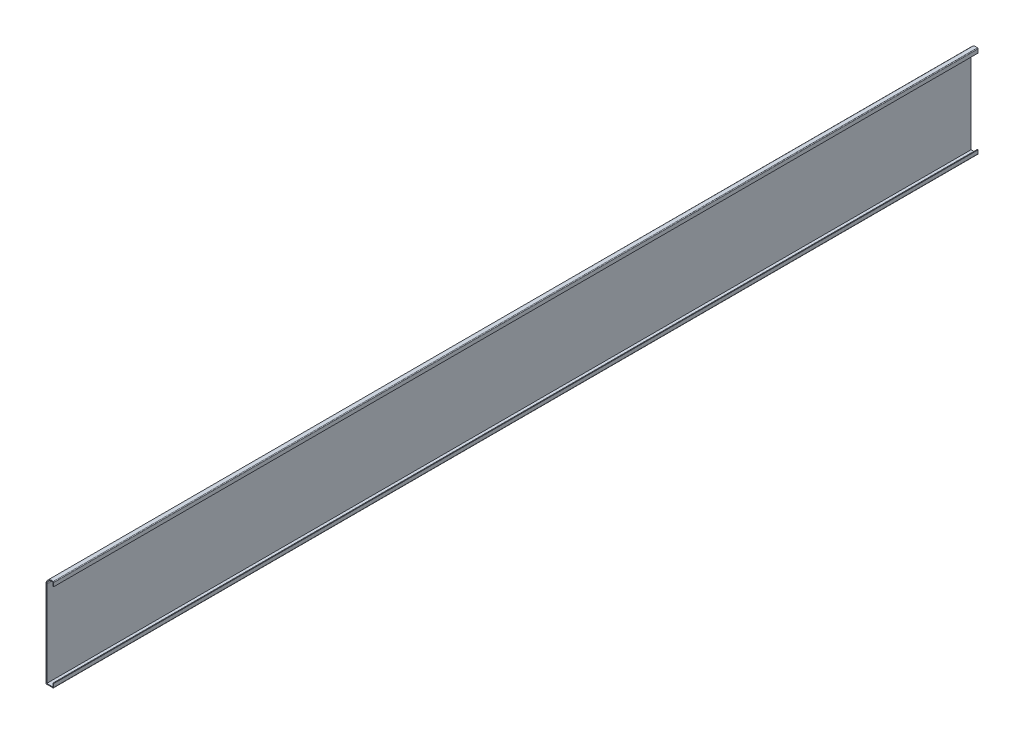
ISO-10303-21;
HEADER;
FILE_DESCRIPTION(('STEP AP214'),'2;1');
FILE_NAME('part.step','',(''),(''),'','','');
FILE_SCHEMA(('AUTOMOTIVE_DESIGN { 1 0 10303 214 1 1 1 1 }'));
ENDSEC;
DATA;
#1=APPLICATION_CONTEXT('core data for automotive mechanical design processes');
#2=APPLICATION_PROTOCOL_DEFINITION('international standard','automotive_design',2000,#1);
#3=PRODUCT_CONTEXT('',#1,'mechanical');
#4=PRODUCT('Part','Part','',(#3));
#5=PRODUCT_RELATED_PRODUCT_CATEGORY('part','',(#4));
#6=PRODUCT_DEFINITION_FORMATION('','',#4);
#7=PRODUCT_DEFINITION_CONTEXT('part definition',#1,'design');
#8=PRODUCT_DEFINITION('design','',#6,#7);
#9=PRODUCT_DEFINITION_SHAPE('','',#8);
#10=(LENGTH_UNIT() NAMED_UNIT(*) SI_UNIT(.MILLI.,.METRE.));
#11=(NAMED_UNIT(*) PLANE_ANGLE_UNIT() SI_UNIT($,.RADIAN.));
#12=(NAMED_UNIT(*) SI_UNIT($,.STERADIAN.) SOLID_ANGLE_UNIT());
#13=UNCERTAINTY_MEASURE_WITH_UNIT(LENGTH_MEASURE(1.E-05),#10,'distance_accuracy_value','');
#14=(GEOMETRIC_REPRESENTATION_CONTEXT(3) GLOBAL_UNCERTAINTY_ASSIGNED_CONTEXT((#13)) GLOBAL_UNIT_ASSIGNED_CONTEXT((#10,
#11,#12)) REPRESENTATION_CONTEXT('',''));
#15=CARTESIAN_POINT('',(0.,0.,0.));
#16=DIRECTION('',(0.,0.,1.));
#17=DIRECTION('',(1.,0.,0.));
#18=AXIS2_PLACEMENT_3D('',#15,#16,#17);
#19=CARTESIAN_POINT('',(-1.27,151.855256121069,-1524.));
#20=DIRECTION('',(-1.,0.,0.));
#21=DIRECTION('',(0.,-1.,0.));
#22=AXIS2_PLACEMENT_3D('',#19,#20,#21);
#23=PLANE('',#22);
#24=DIRECTION('',(0.,-1.,0.));
#25=VECTOR('',#24,1.);
#26=CARTESIAN_POINT('',(-1.27,151.855256121069,0.));
#27=LINE('',#26,#25);
#28=CARTESIAN_POINT('',(-1.27,150.907185256828,0.));
#29=VERTEX_POINT('',#28);
#30=CARTESIAN_POINT('',(-1.27,144.997256121069,0.));
#31=VERTEX_POINT('',#30);
#32=EDGE_CURVE('E194',#29,#31,#27,.T.);
#33=ORIENTED_EDGE('',*,*,#32,.F.);
#34=DIRECTION('',(0.,0.,1.));
#35=VECTOR('',#34,1.);
#36=CARTESIAN_POINT('',(-1.27,150.907185256828,-1524.));
#37=LINE('',#36,#35);
#38=CARTESIAN_POINT('',(-1.27,150.907185256828,-1524.));
#39=VERTEX_POINT('',#38);
#40=EDGE_CURVE('E165',#39,#29,#37,.T.);
#41=ORIENTED_EDGE('',*,*,#40,.F.);
#42=DIRECTION('',(0.,-1.,0.));
#43=VECTOR('',#42,1.);
#44=CARTESIAN_POINT('',(-1.27,151.855256121069,-1524.));
#45=LINE('',#44,#43);
#46=CARTESIAN_POINT('',(-1.27,144.997256121069,-1524.));
#47=VERTEX_POINT('',#46);
#48=EDGE_CURVE('E147',#39,#47,#45,.T.);
#49=ORIENTED_EDGE('',*,*,#48,.T.);
#50=DIRECTION('',(0.,0.,1.));
#51=VECTOR('',#50,1.);
#52=CARTESIAN_POINT('',(-1.27,144.997256121069,-1524.));
#53=LINE('',#52,#51);
#54=EDGE_CURVE('E155',#47,#31,#53,.T.);
#55=ORIENTED_EDGE('',*,*,#54,.T.);
#56=EDGE_LOOP('',(#33,#41,#49,#55));
#57=FACE_BOUND('',#56,.T.);
#58=ADVANCED_FACE('F35',(#57),#23,.T.);
#59=CARTESIAN_POINT('',(-3.175,142.875,-1524.));
#60=DIRECTION('',(0.,0.,1.));
#61=DIRECTION('',(1.,0.,0.));
#62=AXIS2_PLACEMENT_3D('',#59,#60,#61);
#63=CYLINDRICAL_SURFACE('',#62,8.255);
#64=CARTESIAN_POINT('',(-3.175,142.875,0.));
#65=DIRECTION('',(0.,0.,1.));
#66=DIRECTION('',(1.,0.,0.));
#67=AXIS2_PLACEMENT_3D('',#64,#65,#66);
#68=CIRCLE('',#67,8.255);
#69=CARTESIAN_POINT('',(-11.43,142.875,0.));
#70=VERTEX_POINT('',#69);
#71=EDGE_CURVE('E166',#70,#29,#68,.F.);
#72=ORIENTED_EDGE('',*,*,#71,.F.);
#73=DIRECTION('',(0.,0.,1.));
#74=VECTOR('',#73,1.);
#75=CARTESIAN_POINT('',(-11.43,142.875,-1524.));
#76=LINE('',#75,#74);
#77=CARTESIAN_POINT('',(-11.43,142.875,-1524.));
#78=VERTEX_POINT('',#77);
#79=EDGE_CURVE('E221',#78,#70,#76,.T.);
#80=ORIENTED_EDGE('',*,*,#79,.F.);
#81=CARTESIAN_POINT('',(-3.175,142.875,-1524.));
#82=DIRECTION('',(0.,0.,1.));
#83=DIRECTION('',(1.,0.,0.));
#84=AXIS2_PLACEMENT_3D('',#81,#82,#83);
#85=CIRCLE('',#84,8.255);
#86=EDGE_CURVE('E163',#78,#39,#85,.F.);
#87=ORIENTED_EDGE('',*,*,#86,.T.);
#88=ORIENTED_EDGE('',*,*,#40,.T.);
#89=EDGE_LOOP('',(#72,#80,#87,#88));
#90=FACE_BOUND('',#89,.T.);
#91=ADVANCED_FACE('F268',(#90),#63,.F.);
#92=CARTESIAN_POINT('',(-11.43,0.,-1524.));
#93=DIRECTION('',(1.,0.,0.));
#94=DIRECTION('',(0.,1.,0.));
#95=AXIS2_PLACEMENT_3D('',#92,#93,#94);
#96=PLANE('',#95);
#97=DIRECTION('',(0.,1.,0.));
#98=VECTOR('',#97,1.);
#99=CARTESIAN_POINT('',(-11.43,0.,0.));
#100=LINE('',#99,#98);
#101=CARTESIAN_POINT('',(-11.43,1.27,0.));
#102=VERTEX_POINT('',#101);
#103=EDGE_CURVE('E169',#102,#70,#100,.T.);
#104=ORIENTED_EDGE('',*,*,#103,.F.);
#105=DIRECTION('',(0.,0.,1.));
#106=VECTOR('',#105,1.);
#107=CARTESIAN_POINT('',(-11.43,1.27,-1524.));
#108=LINE('',#107,#106);
#109=CARTESIAN_POINT('',(-11.43,1.27,-1524.));
#110=VERTEX_POINT('',#109);
#111=EDGE_CURVE('E223',#110,#102,#108,.T.);
#112=ORIENTED_EDGE('',*,*,#111,.F.);
#113=DIRECTION('',(0.,1.,0.));
#114=VECTOR('',#113,1.);
#115=CARTESIAN_POINT('',(-11.43,0.,-1524.));
#116=LINE('',#115,#114);
#117=EDGE_CURVE('E190',#110,#78,#116,.T.);
#118=ORIENTED_EDGE('',*,*,#117,.T.);
#119=ORIENTED_EDGE('',*,*,#79,.T.);
#120=EDGE_LOOP('',(#104,#112,#118,#119));
#121=FACE_BOUND('',#120,.T.);
#122=ADVANCED_FACE('F316',(#121),#96,.T.);
#123=CARTESIAN_POINT('',(0.,1.27,-1524.));
#124=DIRECTION('',(0.,1.,0.));
#125=DIRECTION('',(-1.,0.,0.));
#126=AXIS2_PLACEMENT_3D('',#123,#124,#125);
#127=PLANE('',#126);
#128=DIRECTION('',(-1.,0.,0.));
#129=VECTOR('',#128,1.);
#130=CARTESIAN_POINT('',(0.,1.27,0.));
#131=LINE('',#130,#129);
#132=CARTESIAN_POINT('',(-1.27,1.27,0.));
#133=VERTEX_POINT('',#132);
#134=EDGE_CURVE('E214',#133,#102,#131,.T.);
#135=ORIENTED_EDGE('',*,*,#134,.F.);
#136=DIRECTION('',(0.,0.,1.));
#137=VECTOR('',#136,1.);
#138=CARTESIAN_POINT('',(-1.27,1.27,-1524.));
#139=LINE('',#138,#137);
#140=CARTESIAN_POINT('',(-1.27,1.27,-1524.));
#141=VERTEX_POINT('',#140);
#142=EDGE_CURVE('E225',#141,#133,#139,.T.);
#143=ORIENTED_EDGE('',*,*,#142,.F.);
#144=DIRECTION('',(-1.,0.,0.));
#145=VECTOR('',#144,1.);
#146=CARTESIAN_POINT('',(0.,1.27,-1524.));
#147=LINE('',#146,#145);
#148=EDGE_CURVE('E187',#141,#110,#147,.T.);
#149=ORIENTED_EDGE('',*,*,#148,.T.);
#150=ORIENTED_EDGE('',*,*,#111,.T.);
#151=EDGE_LOOP('',(#135,#143,#149,#150));
#152=FACE_BOUND('',#151,.T.);
#153=ADVANCED_FACE('F275',(#152),#127,.T.);
#154=CARTESIAN_POINT('',(-1.26999999999998,6.858,-1524.));
#155=DIRECTION('',(-1.,0.,0.));
#156=DIRECTION('',(0.,-1.,0.));
#157=AXIS2_PLACEMENT_3D('',#154,#155,#156);
#158=PLANE('',#157);
#159=DIRECTION('',(0.,-1.,0.));
#160=VECTOR('',#159,1.);
#161=CARTESIAN_POINT('',(-1.26999999999998,6.858,0.));
#162=LINE('',#161,#160);
#163=CARTESIAN_POINT('',(-1.26999999999998,6.858,0.));
#164=VERTEX_POINT('',#163);
#165=EDGE_CURVE('E211',#164,#133,#162,.T.);
#166=ORIENTED_EDGE('',*,*,#165,.F.);
#167=DIRECTION('',(0.,0.,1.));
#168=VECTOR('',#167,1.);
#169=CARTESIAN_POINT('',(-1.26999999999998,6.858,-1524.));
#170=LINE('',#169,#168);
#171=CARTESIAN_POINT('',(-1.26999999999998,6.858,-1524.));
#172=VERTEX_POINT('',#171);
#173=EDGE_CURVE('E227',#172,#164,#170,.T.);
#174=ORIENTED_EDGE('',*,*,#173,.F.);
#175=DIRECTION('',(0.,-1.,0.));
#176=VECTOR('',#175,1.);
#177=CARTESIAN_POINT('',(-1.26999999999998,6.858,-1524.));
#178=LINE('',#177,#176);
#179=EDGE_CURVE('E184',#172,#141,#178,.T.);
#180=ORIENTED_EDGE('',*,*,#179,.T.);
#181=ORIENTED_EDGE('',*,*,#142,.T.);
#182=EDGE_LOOP('',(#166,#174,#180,#181));
#183=FACE_BOUND('',#182,.T.);
#184=ADVANCED_FACE('F278',(#183),#158,.T.);
#185=CARTESIAN_POINT('',(-1.26999999999998,6.858,-1524.));
#186=DIRECTION('',(0.,-1.,0.));
#187=DIRECTION('',(1.,0.,0.));
#188=AXIS2_PLACEMENT_3D('',#185,#186,#187);
#189=PLANE('',#188);
#190=DIRECTION('',(1.,0.,0.));
#191=VECTOR('',#190,1.);
#192=CARTESIAN_POINT('',(-1.26999999999998,6.858,0.));
#193=LINE('',#192,#191);
#194=CARTESIAN_POINT('',(0.,6.858,0.));
#195=VERTEX_POINT('',#194);
#196=EDGE_CURVE('E209',#164,#195,#193,.T.);
#197=ORIENTED_EDGE('',*,*,#196,.T.);
#198=DIRECTION('',(0.,0.,1.));
#199=VECTOR('',#198,1.);
#200=CARTESIAN_POINT('',(0.,6.858,-1524.));
#201=LINE('',#200,#199);
#202=CARTESIAN_POINT('',(0.,6.858,-1524.));
#203=VERTEX_POINT('',#202);
#204=EDGE_CURVE('E229',#203,#195,#201,.T.);
#205=ORIENTED_EDGE('',*,*,#204,.F.);
#206=DIRECTION('',(1.,0.,0.));
#207=VECTOR('',#206,1.);
#208=CARTESIAN_POINT('',(-1.26999999999998,6.858,-1524.));
#209=LINE('',#208,#207);
#210=EDGE_CURVE('E182',#172,#203,#209,.T.);
#211=ORIENTED_EDGE('',*,*,#210,.F.);
#212=ORIENTED_EDGE('',*,*,#173,.T.);
#213=EDGE_LOOP('',(#197,#205,#211,#212));
#214=FACE_BOUND('',#213,.T.);
#215=ADVANCED_FACE('F284',(#214),#189,.F.);
#216=CARTESIAN_POINT('',(0.,6.858,-1524.));
#217=DIRECTION('',(-1.,0.,0.));
#218=DIRECTION('',(0.,-1.,0.));
#219=AXIS2_PLACEMENT_3D('',#216,#217,#218);
#220=PLANE('',#219);
#221=DIRECTION('',(0.,-1.,0.));
#222=VECTOR('',#221,1.);
#223=CARTESIAN_POINT('',(0.,6.858,0.));
#224=LINE('',#223,#222);
#225=CARTESIAN_POINT('',(0.,1.27,0.));
#226=VERTEX_POINT('',#225);
#227=EDGE_CURVE('E206',#195,#226,#224,.T.);
#228=ORIENTED_EDGE('',*,*,#227,.T.);
#229=DIRECTION('',(0.,0.,1.));
#230=VECTOR('',#229,1.);
#231=CARTESIAN_POINT('',(0.,1.27,-1524.));
#232=LINE('',#231,#230);
#233=CARTESIAN_POINT('',(0.,1.27,-1524.));
#234=VERTEX_POINT('',#233);
#235=EDGE_CURVE('E254',#226,#234,#232,.F.);
#236=ORIENTED_EDGE('',*,*,#235,.T.);
#237=DIRECTION('',(0.,-1.,0.));
#238=VECTOR('',#237,1.);
#239=CARTESIAN_POINT('',(0.,6.858,-1524.));
#240=LINE('',#239,#238);
#241=EDGE_CURVE('E179',#203,#234,#240,.T.);
#242=ORIENTED_EDGE('',*,*,#241,.F.);
#243=ORIENTED_EDGE('',*,*,#204,.T.);
#244=EDGE_LOOP('',(#228,#236,#242,#243));
#245=FACE_BOUND('',#244,.T.);
#246=ADVANCED_FACE('F288',(#245),#220,.F.);
#247=CARTESIAN_POINT('',(0.,0.,-1524.));
#248=DIRECTION('',(0.,1.,0.));
#249=DIRECTION('',(-1.,0.,0.));
#250=AXIS2_PLACEMENT_3D('',#247,#248,#249);
#251=PLANE('',#250);
#252=DIRECTION('',(-1.,0.,0.));
#253=VECTOR('',#252,1.);
#254=CARTESIAN_POINT('',(0.,0.,0.));
#255=LINE('',#254,#253);
#256=CARTESIAN_POINT('',(-1.27,0.,0.));
#257=VERTEX_POINT('',#256);
#258=CARTESIAN_POINT('',(-11.43,0.,0.));
#259=VERTEX_POINT('',#258);
#260=EDGE_CURVE('E203',#257,#259,#255,.T.);
#261=ORIENTED_EDGE('',*,*,#260,.T.);
#262=DIRECTION('',(0.,0.,1.));
#263=VECTOR('',#262,1.);
#264=CARTESIAN_POINT('',(-11.43,0.,-1524.));
#265=LINE('',#264,#263);
#266=CARTESIAN_POINT('',(-11.43,0.,-1524.));
#267=VERTEX_POINT('',#266);
#268=EDGE_CURVE('E247',#259,#267,#265,.F.);
#269=ORIENTED_EDGE('',*,*,#268,.T.);
#270=DIRECTION('',(-1.,0.,0.));
#271=VECTOR('',#270,1.);
#272=CARTESIAN_POINT('',(0.,0.,-1524.));
#273=LINE('',#272,#271);
#274=CARTESIAN_POINT('',(-1.27,0.,-1524.));
#275=VERTEX_POINT('',#274);
#276=EDGE_CURVE('E177',#275,#267,#273,.T.);
#277=ORIENTED_EDGE('',*,*,#276,.F.);
#278=DIRECTION('',(0.,0.,1.));
#279=VECTOR('',#278,1.);
#280=CARTESIAN_POINT('',(-1.27,0.,-1524.));
#281=LINE('',#280,#279);
#282=EDGE_CURVE('E244',#275,#257,#281,.T.);
#283=ORIENTED_EDGE('',*,*,#282,.T.);
#284=EDGE_LOOP('',(#261,#269,#277,#283));
#285=FACE_BOUND('',#284,.T.);
#286=ADVANCED_FACE('F296',(#285),#251,.F.);
#287=CARTESIAN_POINT('',(-12.7,0.,-1524.));
#288=DIRECTION('',(1.,0.,0.));
#289=DIRECTION('',(0.,1.,0.));
#290=AXIS2_PLACEMENT_3D('',#287,#288,#289);
#291=PLANE('',#290);
#292=DIRECTION('',(0.,1.,0.));
#293=VECTOR('',#292,1.);
#294=CARTESIAN_POINT('',(-12.7,0.,-1524.));
#295=LINE('',#294,#293);
#296=CARTESIAN_POINT('',(-12.7,1.27,-1524.));
#297=VERTEX_POINT('',#296);
#298=CARTESIAN_POINT('',(-12.7,142.875,-1524.));
#299=VERTEX_POINT('',#298);
#300=EDGE_CURVE('E175',#297,#299,#295,.T.);
#301=ORIENTED_EDGE('',*,*,#300,.F.);
#302=DIRECTION('',(0.,0.,1.));
#303=VECTOR('',#302,1.);
#304=CARTESIAN_POINT('',(-12.7,1.27,-1524.));
#305=LINE('',#304,#303);
#306=CARTESIAN_POINT('',(-12.7,1.27,0.));
#307=VERTEX_POINT('',#306);
#308=EDGE_CURVE('E220',#297,#307,#305,.T.);
#309=ORIENTED_EDGE('',*,*,#308,.T.);
#310=DIRECTION('',(0.,1.,0.));
#311=VECTOR('',#310,1.);
#312=CARTESIAN_POINT('',(-12.7,0.,0.));
#313=LINE('',#312,#311);
#314=CARTESIAN_POINT('',(-12.7,142.875,0.));
#315=VERTEX_POINT('',#314);
#316=EDGE_CURVE('E201',#307,#315,#313,.T.);
#317=ORIENTED_EDGE('',*,*,#316,.T.);
#318=DIRECTION('',(0.,0.,1.));
#319=VECTOR('',#318,1.);
#320=CARTESIAN_POINT('',(-12.7,142.875,-1524.));
#321=LINE('',#320,#319);
#322=EDGE_CURVE('E232',#299,#315,#321,.T.);
#323=ORIENTED_EDGE('',*,*,#322,.F.);
#324=EDGE_LOOP('',(#301,#309,#317,#323));
#325=FACE_BOUND('',#324,.T.);
#326=ADVANCED_FACE('F305',(#325),#291,.F.);
#327=CARTESIAN_POINT('',(-3.175,142.875,-1524.));
#328=DIRECTION('',(0.,0.,1.));
#329=DIRECTION('',(1.,0.,0.));
#330=AXIS2_PLACEMENT_3D('',#327,#328,#329);
#331=CYLINDRICAL_SURFACE('',#330,9.525);
#332=CARTESIAN_POINT('',(-3.175,142.875,0.));
#333=DIRECTION('',(0.,0.,-1.));
#334=DIRECTION('',(-1.,0.,0.));
#335=AXIS2_PLACEMENT_3D('',#332,#333,#334);
#336=CIRCLE('',#335,9.525);
#337=CARTESIAN_POINT('',(-0.976923076923076,152.14290606557,0.));
#338=VERTEX_POINT('',#337);
#339=EDGE_CURVE('E199',#315,#338,#336,.T.);
#340=ORIENTED_EDGE('',*,*,#339,.T.);
#341=DIRECTION('',(0.,0.,1.));
#342=VECTOR('',#341,1.);
#343=CARTESIAN_POINT('',(-0.976923076923075,152.14290606557,-1524.));
#344=LINE('',#343,#342);
#345=CARTESIAN_POINT('',(-0.976923076923076,152.14290606557,-1524.));
#346=VERTEX_POINT('',#345);
#347=EDGE_CURVE('E11',#338,#346,#344,.F.);
#348=ORIENTED_EDGE('',*,*,#347,.T.);
#349=CARTESIAN_POINT('',(-3.175,142.875,-1524.));
#350=DIRECTION('',(0.,0.,-1.));
#351=DIRECTION('',(-1.,0.,0.));
#352=AXIS2_PLACEMENT_3D('',#349,#350,#351);
#353=CIRCLE('',#352,9.525);
#354=EDGE_CURVE('E173',#299,#346,#353,.T.);
#355=ORIENTED_EDGE('',*,*,#354,.F.);
#356=ORIENTED_EDGE('',*,*,#322,.T.);
#357=EDGE_LOOP('',(#340,#348,#355,#356));
#358=FACE_BOUND('',#357,.T.);
#359=ADVANCED_FACE('F306',(#358),#331,.T.);
#360=CARTESIAN_POINT('',(0.,151.855256121069,-1524.));
#361=DIRECTION('',(-1.,0.,0.));
#362=DIRECTION('',(0.,-1.,0.));
#363=AXIS2_PLACEMENT_3D('',#360,#361,#362);
#364=PLANE('',#363);
#365=DIRECTION('',(0.,-1.,0.));
#366=VECTOR('',#365,1.);
#367=CARTESIAN_POINT('',(0.,151.855256121069,-1524.));
#368=LINE('',#367,#366);
#369=CARTESIAN_POINT('',(0.,150.907185256828,-1524.));
#370=VERTEX_POINT('',#369);
#371=CARTESIAN_POINT('',(0.,144.997256121069,-1524.));
#372=VERTEX_POINT('',#371);
#373=EDGE_CURVE('E149',#370,#372,#368,.T.);
#374=ORIENTED_EDGE('',*,*,#373,.F.);
#375=DIRECTION('',(0.,0.,1.));
#376=VECTOR('',#375,1.);
#377=CARTESIAN_POINT('',(0.,150.907185256828,-1524.));
#378=LINE('',#377,#376);
#379=CARTESIAN_POINT('',(0.,150.907185256828,0.));
#380=VERTEX_POINT('',#379);
#381=EDGE_CURVE('E43',#370,#380,#378,.T.);
#382=ORIENTED_EDGE('',*,*,#381,.T.);
#383=DIRECTION('',(0.,-1.,0.));
#384=VECTOR('',#383,1.);
#385=CARTESIAN_POINT('',(0.,151.855256121069,0.));
#386=LINE('',#385,#384);
#387=CARTESIAN_POINT('',(0.,144.997256121069,0.));
#388=VERTEX_POINT('',#387);
#389=EDGE_CURVE('E197',#380,#388,#386,.T.);
#390=ORIENTED_EDGE('',*,*,#389,.T.);
#391=DIRECTION('',(0.,0.,1.));
#392=VECTOR('',#391,1.);
#393=CARTESIAN_POINT('',(0.,144.997256121069,-1524.));
#394=LINE('',#393,#392);
#395=EDGE_CURVE('E162',#372,#388,#394,.T.);
#396=ORIENTED_EDGE('',*,*,#395,.F.);
#397=EDGE_LOOP('',(#374,#382,#390,#396));
#398=FACE_BOUND('',#397,.T.);
#399=ADVANCED_FACE('F259',(#398),#364,.F.);
#400=CARTESIAN_POINT('',(0.,144.997256121069,-1524.));
#401=DIRECTION('',(0.,1.,0.));
#402=DIRECTION('',(0.,0.,1.));
#403=AXIS2_PLACEMENT_3D('',#400,#401,#402);
#404=PLANE('',#403);
#405=DIRECTION('',(-1.,0.,0.));
#406=VECTOR('',#405,1.);
#407=CARTESIAN_POINT('',(0.,144.997256121069,0.));
#408=LINE('',#407,#406);
#409=EDGE_CURVE('E158',#388,#31,#408,.T.);
#410=ORIENTED_EDGE('',*,*,#409,.T.);
#411=ORIENTED_EDGE('',*,*,#54,.F.);
#412=DIRECTION('',(-1.,0.,0.));
#413=VECTOR('',#412,1.);
#414=CARTESIAN_POINT('',(0.,144.997256121069,-1524.));
#415=LINE('',#414,#413);
#416=EDGE_CURVE('E141',#372,#47,#415,.T.);
#417=ORIENTED_EDGE('',*,*,#416,.F.);
#418=ORIENTED_EDGE('',*,*,#395,.T.);
#419=EDGE_LOOP('',(#410,#411,#417,#418));
#420=FACE_BOUND('',#419,.T.);
#421=ADVANCED_FACE('F156',(#420),#404,.F.);
#422=CARTESIAN_POINT('',(-3.175,142.875,-1524.));
#423=DIRECTION('',(0.,0.,-1.));
#424=DIRECTION('',(-1.,0.,0.));
#425=AXIS2_PLACEMENT_3D('',#422,#423,#424);
#426=PLANE('',#425);
#427=ORIENTED_EDGE('',*,*,#276,.T.);
#428=CARTESIAN_POINT('',(-11.43,1.27,-1524.));
#429=DIRECTION('',(0.,0.,-1.));
#430=DIRECTION('',(-1.,0.,0.));
#431=AXIS2_PLACEMENT_3D('',#428,#429,#430);
#432=CIRCLE('',#431,1.27);
#433=EDGE_CURVE('E252',#267,#297,#432,.T.);
#434=ORIENTED_EDGE('',*,*,#433,.T.);
#435=ORIENTED_EDGE('',*,*,#300,.T.);
#436=ORIENTED_EDGE('',*,*,#354,.T.);
#437=CARTESIAN_POINT('',(-1.27,150.907185256828,-1524.));
#438=DIRECTION('',(0.,0.,-1.));
#439=DIRECTION('',(-1.,0.,0.));
#440=AXIS2_PLACEMENT_3D('',#437,#438,#439);
#441=CIRCLE('',#440,1.27);
#442=EDGE_CURVE('E50',#346,#370,#441,.T.);
#443=ORIENTED_EDGE('',*,*,#442,.T.);
#444=ORIENTED_EDGE('',*,*,#373,.T.);
#445=ORIENTED_EDGE('',*,*,#416,.T.);
#446=ORIENTED_EDGE('',*,*,#48,.F.);
#447=ORIENTED_EDGE('',*,*,#86,.F.);
#448=ORIENTED_EDGE('',*,*,#117,.F.);
#449=ORIENTED_EDGE('',*,*,#148,.F.);
#450=ORIENTED_EDGE('',*,*,#179,.F.);
#451=ORIENTED_EDGE('',*,*,#210,.T.);
#452=ORIENTED_EDGE('',*,*,#241,.T.);
#453=CARTESIAN_POINT('',(-1.27,1.27,-1524.));
#454=DIRECTION('',(0.,0.,-1.));
#455=DIRECTION('',(-1.,0.,0.));
#456=AXIS2_PLACEMENT_3D('',#453,#454,#455);
#457=CIRCLE('',#456,1.27);
#458=EDGE_CURVE('E250',#234,#275,#457,.T.);
#459=ORIENTED_EDGE('',*,*,#458,.T.);
#460=EDGE_LOOP('',(#427,#434,#435,#436,#443,#444,#445,#446,#447,#448,#449,#450,#451,#452,#459));
#461=FACE_BOUND('',#460,.T.);
#462=ADVANCED_FACE('F144',(#461),#426,.T.);
#463=CARTESIAN_POINT('',(-3.175,142.875,0.));
#464=DIRECTION('',(0.,0.,-1.));
#465=DIRECTION('',(-1.,0.,0.));
#466=AXIS2_PLACEMENT_3D('',#463,#464,#465);
#467=PLANE('',#466);
#468=ORIENTED_EDGE('',*,*,#316,.F.);
#469=CARTESIAN_POINT('',(-11.43,1.27,0.));
#470=DIRECTION('',(0.,0.,-1.));
#471=DIRECTION('',(-1.,0.,0.));
#472=AXIS2_PLACEMENT_3D('',#469,#470,#471);
#473=CIRCLE('',#472,1.27);
#474=EDGE_CURVE('E242',#307,#259,#473,.F.);
#475=ORIENTED_EDGE('',*,*,#474,.T.);
#476=ORIENTED_EDGE('',*,*,#260,.F.);
#477=CARTESIAN_POINT('',(-1.27,1.27,0.));
#478=DIRECTION('',(0.,0.,-1.));
#479=DIRECTION('',(-1.,0.,0.));
#480=AXIS2_PLACEMENT_3D('',#477,#478,#479);
#481=CIRCLE('',#480,1.27);
#482=EDGE_CURVE('E240',#257,#226,#481,.F.);
#483=ORIENTED_EDGE('',*,*,#482,.T.);
#484=ORIENTED_EDGE('',*,*,#227,.F.);
#485=ORIENTED_EDGE('',*,*,#196,.F.);
#486=ORIENTED_EDGE('',*,*,#165,.T.);
#487=ORIENTED_EDGE('',*,*,#134,.T.);
#488=ORIENTED_EDGE('',*,*,#103,.T.);
#489=ORIENTED_EDGE('',*,*,#71,.T.);
#490=ORIENTED_EDGE('',*,*,#32,.T.);
#491=ORIENTED_EDGE('',*,*,#409,.F.);
#492=ORIENTED_EDGE('',*,*,#389,.F.);
#493=CARTESIAN_POINT('',(-1.27,150.907185256828,0.));
#494=DIRECTION('',(0.,0.,-1.));
#495=DIRECTION('',(-1.,0.,0.));
#496=AXIS2_PLACEMENT_3D('',#493,#494,#495);
#497=CIRCLE('',#496,1.27);
#498=EDGE_CURVE('E238',#380,#338,#497,.F.);
#499=ORIENTED_EDGE('',*,*,#498,.T.);
#500=ORIENTED_EDGE('',*,*,#339,.F.);
#501=EDGE_LOOP('',(#468,#475,#476,#483,#484,#485,#486,#487,#488,#489,#490,#491,#492,#499,#500));
#502=FACE_BOUND('',#501,.T.);
#503=ADVANCED_FACE('F263',(#502),#467,.F.);
#504=CARTESIAN_POINT('',(-11.43,1.27,-1524.));
#505=DIRECTION('',(0.,0.,1.));
#506=DIRECTION('',(1.,0.,0.));
#507=AXIS2_PLACEMENT_3D('',#504,#505,#506);
#508=CYLINDRICAL_SURFACE('',#507,1.27);
#509=ORIENTED_EDGE('',*,*,#433,.F.);
#510=ORIENTED_EDGE('',*,*,#268,.F.);
#511=ORIENTED_EDGE('',*,*,#474,.F.);
#512=ORIENTED_EDGE('',*,*,#308,.F.);
#513=EDGE_LOOP('',(#509,#510,#511,#512));
#514=FACE_BOUND('',#513,.T.);
#515=ADVANCED_FACE('F300',(#514),#508,.T.);
#516=CARTESIAN_POINT('',(-1.27,1.27,-1524.));
#517=DIRECTION('',(0.,0.,1.));
#518=DIRECTION('',(1.,0.,0.));
#519=AXIS2_PLACEMENT_3D('',#516,#517,#518);
#520=CYLINDRICAL_SURFACE('',#519,1.27);
#521=ORIENTED_EDGE('',*,*,#458,.F.);
#522=ORIENTED_EDGE('',*,*,#235,.F.);
#523=ORIENTED_EDGE('',*,*,#482,.F.);
#524=ORIENTED_EDGE('',*,*,#282,.F.);
#525=EDGE_LOOP('',(#521,#522,#523,#524));
#526=FACE_BOUND('',#525,.T.);
#527=ADVANCED_FACE('F291',(#526),#520,.T.);
#528=CARTESIAN_POINT('',(-1.27,150.907185256828,-1524.));
#529=DIRECTION('',(0.,0.,1.));
#530=DIRECTION('',(1.,0.,0.));
#531=AXIS2_PLACEMENT_3D('',#528,#529,#530);
#532=CYLINDRICAL_SURFACE('',#531,1.27);
#533=ORIENTED_EDGE('',*,*,#442,.F.);
#534=ORIENTED_EDGE('',*,*,#347,.F.);
#535=ORIENTED_EDGE('',*,*,#498,.F.);
#536=ORIENTED_EDGE('',*,*,#381,.F.);
#537=EDGE_LOOP('',(#533,#534,#535,#536));
#538=FACE_BOUND('',#537,.T.);
#539=ADVANCED_FACE('F37',(#538),#532,.T.);
#540=CLOSED_SHELL('',(#58,#91,#122,#153,#184,#215,#246,#286,#326,#359,#399,#421,#462,#503,#515,
#527,#539));
#541=MANIFOLD_SOLID_BREP('B2',#540);
#542=ADVANCED_BREP_SHAPE_REPRESENTATION('',(#18,#541),#14);
#543=SHAPE_DEFINITION_REPRESENTATION(#9,#542);
ENDSEC;
END-ISO-10303-21;
